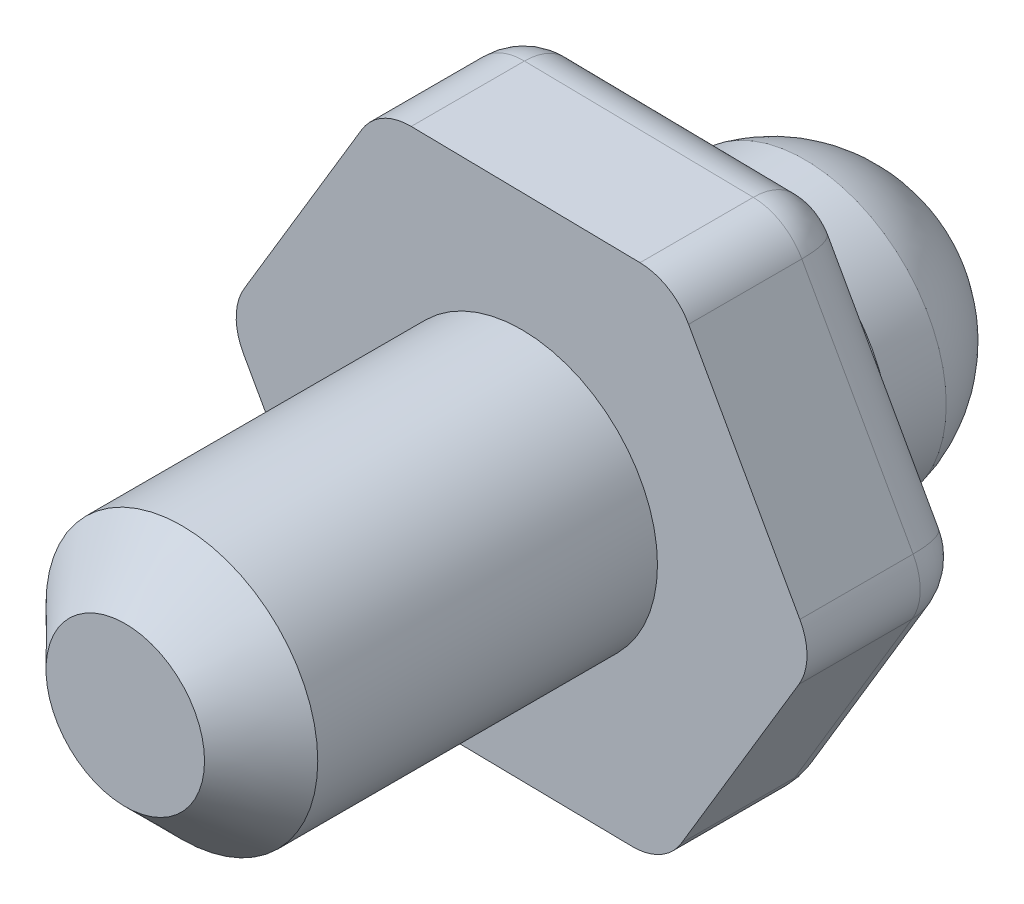
ISO-10303-21;
HEADER;
FILE_DESCRIPTION(('STEP AP214'),'2;1');
FILE_NAME('part.step','',(''),(''),'','','');
FILE_SCHEMA(('AUTOMOTIVE_DESIGN { 1 0 10303 214 1 1 1 1 }'));
ENDSEC;
DATA;
#1=APPLICATION_CONTEXT('core data for automotive mechanical design processes');
#2=APPLICATION_PROTOCOL_DEFINITION('international standard','automotive_design',2000,#1);
#3=PRODUCT_CONTEXT('',#1,'mechanical');
#4=PRODUCT('Part','Part','',(#3));
#5=PRODUCT_RELATED_PRODUCT_CATEGORY('part','',(#4));
#6=PRODUCT_DEFINITION_FORMATION('','',#4);
#7=PRODUCT_DEFINITION_CONTEXT('part definition',#1,'design');
#8=PRODUCT_DEFINITION('design','',#6,#7);
#9=PRODUCT_DEFINITION_SHAPE('','',#8);
#10=(LENGTH_UNIT() NAMED_UNIT(*) SI_UNIT(.MILLI.,.METRE.));
#11=(NAMED_UNIT(*) PLANE_ANGLE_UNIT() SI_UNIT($,.RADIAN.));
#12=(NAMED_UNIT(*) SI_UNIT($,.STERADIAN.) SOLID_ANGLE_UNIT());
#13=UNCERTAINTY_MEASURE_WITH_UNIT(LENGTH_MEASURE(1.E-05),#10,'distance_accuracy_value','');
#14=(GEOMETRIC_REPRESENTATION_CONTEXT(3) GLOBAL_UNCERTAINTY_ASSIGNED_CONTEXT((#13)) GLOBAL_UNIT_ASSIGNED_CONTEXT((#10,
#11,#12)) REPRESENTATION_CONTEXT('',''));
#15=CARTESIAN_POINT('',(0.,0.,0.));
#16=DIRECTION('',(0.,0.,1.));
#17=DIRECTION('',(1.,0.,0.));
#18=AXIS2_PLACEMENT_3D('',#15,#16,#17);
#19=CARTESIAN_POINT('',(-0.180332581401164,-11.4285773462879,-3.81));
#20=DIRECTION('',(0.,0.,1.));
#21=DIRECTION('',(1.,0.,0.));
#22=AXIS2_PLACEMENT_3D('',#19,#20,#21);
#23=PLANE('',#22);
#24=DIRECTION('',(-0.513601160959527,-0.85802904814524,0.));
#25=VECTOR('',#24,1.);
#26=CARTESIAN_POINT('',(-1.27002947254562,-10.7763038718693,-3.81));
#27=LINE('',#26,#25);
#28=CARTESIAN_POINT('',(5.1320050501485,-0.080978383434373,-3.81));
#29=VERTEX_POINT('',#28);
#30=CARTESIAN_POINT('',(2.49587318786269,-4.48493593749582,-3.81));
#31=VERTEX_POINT('',#30);
#32=EDGE_CURVE('E170',#29,#31,#27,.T.);
#33=ORIENTED_EDGE('',*,*,#32,.T.);
#34=DIRECTION('',(-0.999875533358522,0.0157771287315104,0.));
#35=VECTOR('',#34,1.);
#36=CARTESIAN_POINT('',(-0.0701293372115639,-4.44444674577863,-3.81));
#37=LINE('',#36,#35);
#38=CARTESIAN_POINT('',(-2.63613186228581,-4.40395755406144,-3.81));
#39=VERTEX_POINT('',#38);
#40=EDGE_CURVE('E142',#31,#39,#37,.T.);
#41=ORIENTED_EDGE('',*,*,#40,.T.);
#42=DIRECTION('',(-0.486274372398996,0.87380617687675,0.));
#43=VECTOR('',#42,1.);
#44=CARTESIAN_POINT('',(0.92940126323231,-10.8110088933412,-3.81));
#45=LINE('',#44,#43);
#46=CARTESIAN_POINT('',(-5.1320050501485,0.0809783834343736,-3.81));
#47=VERTEX_POINT('',#46);
#48=EDGE_CURVE('E159',#39,#47,#45,.T.);
#49=ORIENTED_EDGE('',*,*,#48,.T.);
#50=DIRECTION('',(0.513601160959527,0.85802904814524,0.));
#51=VECTOR('',#50,1.);
#52=CARTESIAN_POINT('',(-8.8979077105568,-6.21038955093912,-3.81));
#53=LINE('',#52,#51);
#54=CARTESIAN_POINT('',(-2.49587318786268,4.48493593749582,-3.81));
#55=VERTEX_POINT('',#54);
#56=EDGE_CURVE('E165',#47,#55,#53,.T.);
#57=ORIENTED_EDGE('',*,*,#56,.T.);
#58=DIRECTION('',(0.999875533358522,-0.0157771287315104,0.));
#59=VECTOR('',#58,1.);
#60=CARTESIAN_POINT('',(0.0701293372115638,4.44444674577864,-3.81));
#61=LINE('',#60,#59);
#62=CARTESIAN_POINT('',(2.63613186228582,4.40395755406145,-3.81));
#63=VERTEX_POINT('',#62);
#64=EDGE_CURVE('E316',#55,#63,#61,.T.);
#65=ORIENTED_EDGE('',*,*,#64,.T.);
#66=DIRECTION('',(0.486274372398996,-0.873806176876751,0.));
#67=VECTOR('',#66,1.);
#68=CARTESIAN_POINT('',(8.69753817566662,-6.48802972271411,-3.81));
#69=LINE('',#68,#67);
#70=EDGE_CURVE('E175',#63,#29,#69,.T.);
#71=ORIENTED_EDGE('',*,*,#70,.T.);
#72=EDGE_LOOP('',(#33,#41,#49,#57,#65,#71));
#73=FACE_BOUND('',#72,.T.);
#74=CARTESIAN_POINT('',(0.,0.,-3.81));
#75=DIRECTION('',(0.,0.,1.));
#76=DIRECTION('',(1.,0.,0.));
#77=AXIS2_PLACEMENT_3D('',#74,#75,#76);
#78=CIRCLE('',#77,2.02978520685108);
#79=CARTESIAN_POINT('',(2.02978520685108,0.,-3.81));
#80=VERTEX_POINT('',#79);
#81=EDGE_CURVE('E166',#80,#80,#78,.F.);
#82=ORIENTED_EDGE('',*,*,#81,.F.);
#83=EDGE_LOOP('',(#82));
#84=FACE_BOUND('',#83,.T.);
#85=ADVANCED_FACE('F31',(#73,#84),#23,.F.);
#86=CARTESIAN_POINT('',(0.,0.,8.89));
#87=DIRECTION('',(0.,0.,-1.));
#88=DIRECTION('',(-1.,0.,0.));
#89=AXIS2_PLACEMENT_3D('',#86,#87,#88);
#90=CYLINDRICAL_SURFACE('',#89,3.048);
#91=CARTESIAN_POINT('',(0.,0.,7.61999999999999));
#92=DIRECTION('',(0.,0.,1.));
#93=DIRECTION('',(1.,0.,0.));
#94=AXIS2_PLACEMENT_3D('',#91,#92,#93);
#95=CIRCLE('',#94,3.048);
#96=CARTESIAN_POINT('',(3.048,0.,7.61999999999999));
#97=VERTEX_POINT('',#96);
#98=EDGE_CURVE('E308',#97,#97,#95,.F.);
#99=ORIENTED_EDGE('',*,*,#98,.T.);
#100=EDGE_LOOP('',(#99));
#101=FACE_BOUND('',#100,.T.);
#102=CARTESIAN_POINT('',(0.,0.,0.));
#103=DIRECTION('',(0.,0.,1.));
#104=DIRECTION('',(1.,0.,0.));
#105=AXIS2_PLACEMENT_3D('',#102,#103,#104);
#106=CIRCLE('',#105,3.048);
#107=CARTESIAN_POINT('',(3.048,0.,0.));
#108=VERTEX_POINT('',#107);
#109=EDGE_CURVE('E302',#108,#108,#106,.T.);
#110=ORIENTED_EDGE('',*,*,#109,.T.);
#111=EDGE_LOOP('',(#110));
#112=FACE_BOUND('',#111,.T.);
#113=ADVANCED_FACE('F340',(#101,#112),#90,.T.);
#114=CARTESIAN_POINT('',(0.,0.,8.89));
#115=DIRECTION('',(0.,0.,1.));
#116=DIRECTION('',(1.,0.,0.));
#117=AXIS2_PLACEMENT_3D('',#114,#115,#116);
#118=PLANE('',#117);
#119=CARTESIAN_POINT('',(0.,0.,8.89));
#120=DIRECTION('',(0.,0.,1.));
#121=DIRECTION('',(1.,0.,0.));
#122=AXIS2_PLACEMENT_3D('',#119,#120,#121);
#123=CIRCLE('',#122,1.778);
#124=CARTESIAN_POINT('',(1.778,0.,8.89));
#125=VERTEX_POINT('',#124);
#126=EDGE_CURVE('E305',#125,#125,#123,.T.);
#127=ORIENTED_EDGE('',*,*,#126,.T.);
#128=EDGE_LOOP('',(#127));
#129=FACE_BOUND('',#128,.T.);
#130=ADVANCED_FACE('F345',(#129),#118,.T.);
#131=CARTESIAN_POINT('',(0.,0.,8.89));
#132=DIRECTION('',(0.,0.,-1.));
#133=DIRECTION('',(-1.,0.,0.));
#134=AXIS2_PLACEMENT_3D('',#131,#132,#133);
#135=CONICAL_SURFACE('',#134,1.778,0.785398163397447);
#136=ORIENTED_EDGE('',*,*,#98,.F.);
#137=EDGE_LOOP('',(#136));
#138=FACE_BOUND('',#137,.T.);
#139=ORIENTED_EDGE('',*,*,#126,.F.);
#140=EDGE_LOOP('',(#139));
#141=FACE_BOUND('',#140,.T.);
#142=ADVANCED_FACE('F372',(#138,#141),#135,.T.);
#143=CARTESIAN_POINT('',(-0.180332581401164,-11.4285773462879,0.));
#144=DIRECTION('',(0.,0.,1.));
#145=DIRECTION('',(1.,0.,0.));
#146=AXIS2_PLACEMENT_3D('',#143,#144,#145);
#147=PLANE('',#146);
#148=DIRECTION('',(-0.513601160959527,-0.85802904814524,0.));
#149=VECTOR('',#148,1.);
#150=CARTESIAN_POINT('',(6.59829220733379,-0.104115064415622,0.));
#151=LINE('',#150,#149);
#152=CARTESIAN_POINT('',(6.22170194129295,-0.733251857852973,0.));
#153=VERTEX_POINT('',#152);
#154=CARTESIAN_POINT('',(3.58557007900714,-5.13720941191442,0.));
#155=VERTEX_POINT('',#154);
#156=EDGE_CURVE('E224',#153,#155,#151,.T.);
#157=ORIENTED_EDGE('',*,*,#156,.F.);
#158=CARTESIAN_POINT('',(5.1320050501485,-0.0809783834343734,0.));
#159=DIRECTION('',(0.,0.,1.));
#160=DIRECTION('',(1.,0.,0.));
#161=AXIS2_PLACEMENT_3D('',#158,#159,#160);
#162=CIRCLE('',#161,1.27);
#163=CARTESIAN_POINT('',(6.24173889478197,0.536590069512352,0.));
#164=VERTEX_POINT('',#163);
#165=EDGE_CURVE('E11',#153,#164,#162,.T.);
#166=ORIENTED_EDGE('',*,*,#165,.T.);
#167=DIRECTION('',(0.486274372398996,-0.87380617687675,0.));
#168=VECTOR('',#167,1.);
#169=CARTESIAN_POINT('',(3.38931239436748,5.66223114093614,0.));
#170=LINE('',#169,#168);
#171=CARTESIAN_POINT('',(3.74586570691929,5.02152600700817,0.));
#172=VERTEX_POINT('',#171);
#173=EDGE_CURVE('E235',#172,#164,#170,.T.);
#174=ORIENTED_EDGE('',*,*,#173,.F.);
#175=CARTESIAN_POINT('',(2.63613186228581,4.40395755406144,0.));
#176=DIRECTION('',(0.,0.,1.));
#177=DIRECTION('',(1.,0.,0.));
#178=AXIS2_PLACEMENT_3D('',#175,#176,#177);
#179=CIRCLE('',#178,1.27);
#180=CARTESIAN_POINT('',(2.65616881577483,5.67379948142677,0.));
#181=VERTEX_POINT('',#180);
#182=EDGE_CURVE('E214',#172,#181,#179,.T.);
#183=ORIENTED_EDGE('',*,*,#182,.T.);
#184=DIRECTION('',(0.999875533358522,-0.0157771287315104,0.));
#185=VECTOR('',#184,1.);
#186=CARTESIAN_POINT('',(-3.20897981296631,5.76634620535177,0.));
#187=LINE('',#186,#185);
#188=CARTESIAN_POINT('',(-2.47583623437367,5.75477786486114,0.));
#189=VERTEX_POINT('',#188);
#190=EDGE_CURVE('E296',#189,#181,#187,.T.);
#191=ORIENTED_EDGE('',*,*,#190,.F.);
#192=CARTESIAN_POINT('',(-2.49587318786268,4.48493593749582,0.));
#193=DIRECTION('',(0.,0.,1.));
#194=DIRECTION('',(1.,0.,0.));
#195=AXIS2_PLACEMENT_3D('',#192,#193,#194);
#196=CIRCLE('',#195,1.27);
#197=CARTESIAN_POINT('',(-3.58557007900714,5.13720941191442,0.));
#198=VERTEX_POINT('',#197);
#199=EDGE_CURVE('E212',#189,#198,#196,.T.);
#200=ORIENTED_EDGE('',*,*,#199,.T.);
#201=DIRECTION('',(0.513601160959526,0.85802904814524,0.));
#202=VECTOR('',#201,1.);
#203=CARTESIAN_POINT('',(-6.59829220733378,0.104115064415622,0.));
#204=LINE('',#203,#202);
#205=CARTESIAN_POINT('',(-6.22170194129295,0.733251857852972,0.));
#206=VERTEX_POINT('',#205);
#207=EDGE_CURVE('E293',#206,#198,#204,.T.);
#208=ORIENTED_EDGE('',*,*,#207,.F.);
#209=CARTESIAN_POINT('',(-5.1320050501485,0.0809783834343737,0.));
#210=DIRECTION('',(0.,0.,1.));
#211=DIRECTION('',(1.,0.,0.));
#212=AXIS2_PLACEMENT_3D('',#209,#210,#211);
#213=CIRCLE('',#212,1.27);
#214=CARTESIAN_POINT('',(-6.24173889478197,-0.536590069512352,0.));
#215=VERTEX_POINT('',#214);
#216=EDGE_CURVE('E210',#206,#215,#213,.T.);
#217=ORIENTED_EDGE('',*,*,#216,.T.);
#218=DIRECTION('',(-0.486274372398996,0.87380617687675,0.));
#219=VECTOR('',#218,1.);
#220=CARTESIAN_POINT('',(-3.38931239436747,-5.66223114093614,0.));
#221=LINE('',#220,#219);
#222=CARTESIAN_POINT('',(-3.74586570691928,-5.02152600700817,0.));
#223=VERTEX_POINT('',#222);
#224=EDGE_CURVE('E291',#223,#215,#221,.T.);
#225=ORIENTED_EDGE('',*,*,#224,.F.);
#226=CARTESIAN_POINT('',(-2.63613186228581,-4.40395755406144,0.));
#227=DIRECTION('',(0.,0.,1.));
#228=DIRECTION('',(1.,0.,0.));
#229=AXIS2_PLACEMENT_3D('',#226,#227,#228);
#230=CIRCLE('',#229,1.27);
#231=CARTESIAN_POINT('',(-2.65616881577483,-5.67379948142677,0.));
#232=VERTEX_POINT('',#231);
#233=EDGE_CURVE('E216',#223,#232,#230,.T.);
#234=ORIENTED_EDGE('',*,*,#233,.T.);
#235=DIRECTION('',(-0.999875533358522,0.0157771287315104,0.));
#236=VECTOR('',#235,1.);
#237=CARTESIAN_POINT('',(3.20897981296631,-5.76634620535176,0.));
#238=LINE('',#237,#236);
#239=CARTESIAN_POINT('',(2.47583623437367,-5.75477786486114,0.));
#240=VERTEX_POINT('',#239);
#241=EDGE_CURVE('E227',#240,#232,#238,.T.);
#242=ORIENTED_EDGE('',*,*,#241,.F.);
#243=CARTESIAN_POINT('',(2.49587318786269,-4.48493593749582,0.));
#244=DIRECTION('',(0.,0.,1.));
#245=DIRECTION('',(1.,0.,0.));
#246=AXIS2_PLACEMENT_3D('',#243,#244,#245);
#247=CIRCLE('',#246,1.27);
#248=EDGE_CURVE('E39',#240,#155,#247,.T.);
#249=ORIENTED_EDGE('',*,*,#248,.T.);
#250=EDGE_LOOP('',(#157,#166,#174,#183,#191,#200,#208,#217,#225,#234,#242,#249));
#251=FACE_BOUND('',#250,.T.);
#252=ORIENTED_EDGE('',*,*,#109,.F.);
#253=EDGE_LOOP('',(#252));
#254=FACE_BOUND('',#253,.T.);
#255=ADVANCED_FACE('F222',(#251,#254),#147,.T.);
#256=CARTESIAN_POINT('',(-3.38931239436747,-5.66223114093614,-3.81));
#257=DIRECTION('',(0.87380617687675,0.486274372398996,0.));
#258=DIRECTION('',(-0.486274372398996,0.87380617687675,0.));
#259=AXIS2_PLACEMENT_3D('',#256,#257,#258);
#260=PLANE('',#259);
#261=DIRECTION('',(-0.486274372398996,0.87380617687675,0.));
#262=VECTOR('',#261,1.);
#263=CARTESIAN_POINT('',(-3.38931239436747,-5.66223114093614,-2.54));
#264=LINE('',#263,#262);
#265=CARTESIAN_POINT('',(-6.24173889478197,-0.536590069512351,-2.54));
#266=VERTEX_POINT('',#265);
#267=CARTESIAN_POINT('',(-3.74586570691928,-5.02152600700817,-2.54));
#268=VERTEX_POINT('',#267);
#269=EDGE_CURVE('E46',#266,#268,#264,.F.);
#270=ORIENTED_EDGE('',*,*,#269,.T.);
#271=DIRECTION('',(0.,0.,1.));
#272=VECTOR('',#271,1.);
#273=CARTESIAN_POINT('',(-3.74586570691928,-5.02152600700817,-3.81));
#274=LINE('',#273,#272);
#275=EDGE_CURVE('E208',#268,#223,#274,.T.);
#276=ORIENTED_EDGE('',*,*,#275,.T.);
#277=ORIENTED_EDGE('',*,*,#224,.T.);
#278=DIRECTION('',(0.,0.,1.));
#279=VECTOR('',#278,1.);
#280=CARTESIAN_POINT('',(-6.24173889478197,-0.536590069512352,-3.81));
#281=LINE('',#280,#279);
#282=EDGE_CURVE('E51',#215,#266,#281,.F.);
#283=ORIENTED_EDGE('',*,*,#282,.T.);
#284=EDGE_LOOP('',(#270,#276,#277,#283));
#285=FACE_BOUND('',#284,.T.);
#286=ADVANCED_FACE('F368',(#285),#260,.F.);
#287=CARTESIAN_POINT('',(-6.59829220733378,0.104115064415622,-3.81));
#288=DIRECTION('',(0.85802904814524,-0.513601160959526,0.));
#289=DIRECTION('',(0.513601160959527,0.85802904814524,0.));
#290=AXIS2_PLACEMENT_3D('',#287,#288,#289);
#291=PLANE('',#290);
#292=ORIENTED_EDGE('',*,*,#207,.T.);
#293=DIRECTION('',(0.,0.,1.));
#294=VECTOR('',#293,1.);
#295=CARTESIAN_POINT('',(-3.58557007900714,5.13720941191442,-3.81));
#296=LINE('',#295,#294);
#297=CARTESIAN_POINT('',(-3.58557007900714,5.13720941191442,-2.54));
#298=VERTEX_POINT('',#297);
#299=EDGE_CURVE('E204',#198,#298,#296,.F.);
#300=ORIENTED_EDGE('',*,*,#299,.T.);
#301=DIRECTION('',(0.513601160959527,0.85802904814524,0.));
#302=VECTOR('',#301,1.);
#303=CARTESIAN_POINT('',(-6.59829220733378,0.104115064415622,-2.54));
#304=LINE('',#303,#302);
#305=CARTESIAN_POINT('',(-6.22170194129295,0.733251857852972,-2.54));
#306=VERTEX_POINT('',#305);
#307=EDGE_CURVE('E202',#298,#306,#304,.F.);
#308=ORIENTED_EDGE('',*,*,#307,.T.);
#309=DIRECTION('',(0.,0.,1.));
#310=VECTOR('',#309,1.);
#311=CARTESIAN_POINT('',(-6.22170194129295,0.733251857852972,-3.81));
#312=LINE('',#311,#310);
#313=EDGE_CURVE('E200',#306,#206,#312,.T.);
#314=ORIENTED_EDGE('',*,*,#313,.T.);
#315=EDGE_LOOP('',(#292,#300,#308,#314));
#316=FACE_BOUND('',#315,.T.);
#317=ADVANCED_FACE('F364',(#316),#291,.F.);
#318=CARTESIAN_POINT('',(-3.20897981296631,5.76634620535177,-3.81));
#319=DIRECTION('',(-0.0157771287315104,-0.999875533358522,0.));
#320=DIRECTION('',(0.999875533358522,-0.0157771287315104,0.));
#321=AXIS2_PLACEMENT_3D('',#318,#319,#320);
#322=PLANE('',#321);
#323=ORIENTED_EDGE('',*,*,#190,.T.);
#324=DIRECTION('',(0.,0.,1.));
#325=VECTOR('',#324,1.);
#326=CARTESIAN_POINT('',(2.65616881577483,5.67379948142677,-3.81));
#327=LINE('',#326,#325);
#328=CARTESIAN_POINT('',(2.65616881577483,5.67379948142677,-2.54));
#329=VERTEX_POINT('',#328);
#330=EDGE_CURVE('E198',#181,#329,#327,.F.);
#331=ORIENTED_EDGE('',*,*,#330,.T.);
#332=DIRECTION('',(0.999875533358522,-0.0157771287315104,0.));
#333=VECTOR('',#332,1.);
#334=CARTESIAN_POINT('',(-3.20897981296631,5.76634620535177,-2.54));
#335=LINE('',#334,#333);
#336=CARTESIAN_POINT('',(-2.47583623437367,5.75477786486114,-2.54));
#337=VERTEX_POINT('',#336);
#338=EDGE_CURVE('E196',#329,#337,#335,.F.);
#339=ORIENTED_EDGE('',*,*,#338,.T.);
#340=DIRECTION('',(0.,0.,1.));
#341=VECTOR('',#340,1.);
#342=CARTESIAN_POINT('',(-2.47583623437367,5.75477786486114,-3.81));
#343=LINE('',#342,#341);
#344=EDGE_CURVE('E194',#337,#189,#343,.T.);
#345=ORIENTED_EDGE('',*,*,#344,.T.);
#346=EDGE_LOOP('',(#323,#331,#339,#345));
#347=FACE_BOUND('',#346,.T.);
#348=ADVANCED_FACE('F360',(#347),#322,.F.);
#349=CARTESIAN_POINT('',(3.38931239436748,5.66223114093614,-3.81));
#350=DIRECTION('',(-0.873806176876751,-0.486274372398996,0.));
#351=DIRECTION('',(0.486274372398996,-0.873806176876751,0.));
#352=AXIS2_PLACEMENT_3D('',#349,#350,#351);
#353=PLANE('',#352);
#354=ORIENTED_EDGE('',*,*,#173,.T.);
#355=DIRECTION('',(0.,0.,1.));
#356=VECTOR('',#355,1.);
#357=CARTESIAN_POINT('',(6.24173889478197,0.536590069512352,-3.81));
#358=LINE('',#357,#356);
#359=CARTESIAN_POINT('',(6.24173889478197,0.536590069512351,-2.54));
#360=VERTEX_POINT('',#359);
#361=EDGE_CURVE('E192',#164,#360,#358,.F.);
#362=ORIENTED_EDGE('',*,*,#361,.T.);
#363=DIRECTION('',(0.486274372398996,-0.873806176876751,0.));
#364=VECTOR('',#363,1.);
#365=CARTESIAN_POINT('',(3.38931239436748,5.66223114093614,-2.54));
#366=LINE('',#365,#364);
#367=CARTESIAN_POINT('',(3.74586570691929,5.02152600700817,-2.54));
#368=VERTEX_POINT('',#367);
#369=EDGE_CURVE('E190',#360,#368,#366,.F.);
#370=ORIENTED_EDGE('',*,*,#369,.T.);
#371=DIRECTION('',(0.,0.,1.));
#372=VECTOR('',#371,1.);
#373=CARTESIAN_POINT('',(3.74586570691929,5.02152600700817,-3.81));
#374=LINE('',#373,#372);
#375=EDGE_CURVE('E188',#368,#172,#374,.T.);
#376=ORIENTED_EDGE('',*,*,#375,.T.);
#377=EDGE_LOOP('',(#354,#362,#370,#376));
#378=FACE_BOUND('',#377,.T.);
#379=ADVANCED_FACE('F357',(#378),#353,.F.);
#380=CARTESIAN_POINT('',(6.59829220733379,-0.104115064415622,-3.81));
#381=DIRECTION('',(-0.85802904814524,0.513601160959527,0.));
#382=DIRECTION('',(-0.513601160959527,-0.85802904814524,0.));
#383=AXIS2_PLACEMENT_3D('',#380,#381,#382);
#384=PLANE('',#383);
#385=DIRECTION('',(-0.513601160959527,-0.85802904814524,0.));
#386=VECTOR('',#385,1.);
#387=CARTESIAN_POINT('',(6.59829220733379,-0.104115064415622,-2.54));
#388=LINE('',#387,#386);
#389=CARTESIAN_POINT('',(3.58557007900714,-5.13720941191442,-2.54));
#390=VERTEX_POINT('',#389);
#391=CARTESIAN_POINT('',(6.22170194129295,-0.733251857852973,-2.54));
#392=VERTEX_POINT('',#391);
#393=EDGE_CURVE('E184',#390,#392,#388,.F.);
#394=ORIENTED_EDGE('',*,*,#393,.T.);
#395=DIRECTION('',(0.,0.,1.));
#396=VECTOR('',#395,1.);
#397=CARTESIAN_POINT('',(6.22170194129295,-0.733251857852973,-3.81));
#398=LINE('',#397,#396);
#399=EDGE_CURVE('E186',#392,#153,#398,.T.);
#400=ORIENTED_EDGE('',*,*,#399,.T.);
#401=ORIENTED_EDGE('',*,*,#156,.T.);
#402=DIRECTION('',(0.,0.,1.));
#403=VECTOR('',#402,1.);
#404=CARTESIAN_POINT('',(3.58557007900714,-5.13720941191442,-3.81));
#405=LINE('',#404,#403);
#406=EDGE_CURVE('E182',#155,#390,#405,.F.);
#407=ORIENTED_EDGE('',*,*,#406,.T.);
#408=EDGE_LOOP('',(#394,#400,#401,#407));
#409=FACE_BOUND('',#408,.T.);
#410=ADVANCED_FACE('F232',(#409),#384,.F.);
#411=CARTESIAN_POINT('',(3.20897981296631,-5.76634620535176,-3.81));
#412=DIRECTION('',(0.0157771287315104,0.999875533358522,0.));
#413=DIRECTION('',(-0.999875533358522,0.0157771287315104,0.));
#414=AXIS2_PLACEMENT_3D('',#411,#412,#413);
#415=PLANE('',#414);
#416=DIRECTION('',(-0.999875533358522,0.0157771287315104,0.));
#417=VECTOR('',#416,1.);
#418=CARTESIAN_POINT('',(3.20897981296631,-5.76634620535176,-2.54));
#419=LINE('',#418,#417);
#420=CARTESIAN_POINT('',(-2.65616881577483,-5.67379948142677,-2.54));
#421=VERTEX_POINT('',#420);
#422=CARTESIAN_POINT('',(2.47583623437367,-5.75477786486114,-2.54));
#423=VERTEX_POINT('',#422);
#424=EDGE_CURVE('E144',#421,#423,#419,.F.);
#425=ORIENTED_EDGE('',*,*,#424,.T.);
#426=DIRECTION('',(0.,0.,1.));
#427=VECTOR('',#426,1.);
#428=CARTESIAN_POINT('',(2.47583623437367,-5.75477786486114,-3.81));
#429=LINE('',#428,#427);
#430=EDGE_CURVE('E180',#423,#240,#429,.T.);
#431=ORIENTED_EDGE('',*,*,#430,.T.);
#432=ORIENTED_EDGE('',*,*,#241,.T.);
#433=DIRECTION('',(0.,0.,1.));
#434=VECTOR('',#433,1.);
#435=CARTESIAN_POINT('',(-2.65616881577483,-5.67379948142677,-3.81));
#436=LINE('',#435,#434);
#437=EDGE_CURVE('E172',#232,#421,#436,.F.);
#438=ORIENTED_EDGE('',*,*,#437,.T.);
#439=EDGE_LOOP('',(#425,#431,#432,#438));
#440=FACE_BOUND('',#439,.T.);
#441=ADVANCED_FACE('F350',(#440),#415,.F.);
#442=CARTESIAN_POINT('',(0.,0.,-5.08));
#443=DIRECTION('',(0.,0.,1.));
#444=DIRECTION('',(1.,0.,0.));
#445=AXIS2_PLACEMENT_3D('',#442,#443,#444);
#446=CYLINDRICAL_SURFACE('',#445,2.02978520685108);
#447=CARTESIAN_POINT('',(0.,0.,-5.08));
#448=DIRECTION('',(0.,0.,-1.));
#449=DIRECTION('',(-1.,0.,0.));
#450=AXIS2_PLACEMENT_3D('',#447,#448,#449);
#451=CIRCLE('',#450,2.02978520685108);
#452=CARTESIAN_POINT('',(-2.02978520685108,0.,-5.08));
#453=VERTEX_POINT('',#452);
#454=EDGE_CURVE('E288',#453,#453,#451,.T.);
#455=ORIENTED_EDGE('',*,*,#454,.F.);
#456=EDGE_LOOP('',(#455));
#457=FACE_BOUND('',#456,.T.);
#458=ORIENTED_EDGE('',*,*,#81,.T.);
#459=EDGE_LOOP('',(#458));
#460=FACE_BOUND('',#459,.T.);
#461=ADVANCED_FACE('F353',(#457,#460),#446,.T.);
#462=CARTESIAN_POINT('',(0.,0.,-5.08));
#463=DIRECTION('',(0.,0.,-1.));
#464=DIRECTION('',(-1.,0.,0.));
#465=AXIS2_PLACEMENT_3D('',#462,#463,#464);
#466=PLANE('',#465);
#467=CARTESIAN_POINT('',(0.,0.,-5.08));
#468=DIRECTION('',(0.,0.,-1.));
#469=DIRECTION('',(-1.,0.,0.));
#470=AXIS2_PLACEMENT_3D('',#467,#468,#469);
#471=CIRCLE('',#470,3.175);
#472=CARTESIAN_POINT('',(-3.175,0.,-5.08));
#473=VERTEX_POINT('',#472);
#474=EDGE_CURVE('E284',#473,#473,#471,.T.);
#475=ORIENTED_EDGE('',*,*,#474,.F.);
#476=EDGE_LOOP('',(#475));
#477=FACE_BOUND('',#476,.T.);
#478=ORIENTED_EDGE('',*,*,#454,.T.);
#479=EDGE_LOOP('',(#478));
#480=FACE_BOUND('',#479,.T.);
#481=ADVANCED_FACE('F424',(#477,#480),#466,.F.);
#482=CARTESIAN_POINT('',(0.,0.,-6.35));
#483=DIRECTION('',(0.,0.,1.));
#484=DIRECTION('',(1.,0.,0.));
#485=AXIS2_PLACEMENT_3D('',#482,#483,#484);
#486=CYLINDRICAL_SURFACE('',#485,3.175);
#487=CARTESIAN_POINT('',(0.,0.,-6.35));
#488=DIRECTION('',(0.,0.,-1.));
#489=DIRECTION('',(-1.,0.,0.));
#490=AXIS2_PLACEMENT_3D('',#487,#488,#489);
#491=CIRCLE('',#490,3.175);
#492=CARTESIAN_POINT('',(-3.175,0.,-6.35));
#493=VERTEX_POINT('',#492);
#494=EDGE_CURVE('E287',#493,#493,#491,.T.);
#495=ORIENTED_EDGE('',*,*,#494,.F.);
#496=EDGE_LOOP('',(#495));
#497=FACE_BOUND('',#496,.T.);
#498=ORIENTED_EDGE('',*,*,#474,.T.);
#499=EDGE_LOOP('',(#498));
#500=FACE_BOUND('',#499,.T.);
#501=ADVANCED_FACE('F431',(#497,#500),#486,.T.);
#502=CARTESIAN_POINT('',(0.,0.,-5.635625));
#503=DIRECTION('',(0.,0.,1.));
#504=DIRECTION('',(1.,0.,0.));
#505=AXIS2_PLACEMENT_3D('',#502,#503,#504);
#506=SPHERICAL_SURFACE('',#505,3.254375);
#507=ORIENTED_EDGE('',*,*,#494,.T.);
#508=EDGE_LOOP('',(#507));
#509=FACE_BOUND('',#508,.T.);
#510=ADVANCED_FACE('F33',(#509),#506,.T.);
#511=CARTESIAN_POINT('',(2.63613186228581,4.40395755406144,-3.81));
#512=DIRECTION('',(0.,0.,1.));
#513=DIRECTION('',(1.,0.,0.));
#514=AXIS2_PLACEMENT_3D('',#511,#512,#513);
#515=CYLINDRICAL_SURFACE('',#514,1.27);
#516=ORIENTED_EDGE('',*,*,#182,.F.);
#517=ORIENTED_EDGE('',*,*,#375,.F.);
#518=CARTESIAN_POINT('',(2.63613186228581,4.40395755406144,-2.54));
#519=DIRECTION('',(0.,0.,-1.));
#520=DIRECTION('',(-1.,0.,0.));
#521=AXIS2_PLACEMENT_3D('',#518,#519,#520);
#522=CIRCLE('',#521,1.27);
#523=EDGE_CURVE('E281',#329,#368,#522,.T.);
#524=ORIENTED_EDGE('',*,*,#523,.F.);
#525=ORIENTED_EDGE('',*,*,#330,.F.);
#526=EDGE_LOOP('',(#516,#517,#524,#525));
#527=FACE_BOUND('',#526,.T.);
#528=ADVANCED_FACE('F446',(#527),#515,.T.);
#529=CARTESIAN_POINT('',(0.0701293372115638,4.44444674577863,-2.54));
#530=DIRECTION('',(0.999875533358522,-0.0157771287315104,0.));
#531=DIRECTION('',(0.0157771287315104,0.999875533358522,0.));
#532=AXIS2_PLACEMENT_3D('',#529,#530,#531);
#533=CYLINDRICAL_SURFACE('',#532,1.27);
#534=CARTESIAN_POINT('',(-2.49587318786268,4.48493593749582,-2.54));
#535=DIRECTION('',(-0.999875533358522,0.0157771287315105,0.));
#536=DIRECTION('',(-0.0157771287315105,-0.999875533358522,0.));
#537=AXIS2_PLACEMENT_3D('',#534,#535,#536);
#538=CIRCLE('',#537,1.27);
#539=EDGE_CURVE('E275',#337,#55,#538,.T.);
#540=ORIENTED_EDGE('',*,*,#539,.F.);
#541=ORIENTED_EDGE('',*,*,#338,.F.);
#542=CARTESIAN_POINT('',(2.63613186228582,4.40395755406145,-2.54));
#543=DIRECTION('',(0.999875533358522,-0.0157771287315099,0.));
#544=DIRECTION('',(0.0157771287315099,0.999875533358522,0.));
#545=AXIS2_PLACEMENT_3D('',#542,#543,#544);
#546=CIRCLE('',#545,1.27);
#547=EDGE_CURVE('E278',#63,#329,#546,.T.);
#548=ORIENTED_EDGE('',*,*,#547,.F.);
#549=ORIENTED_EDGE('',*,*,#64,.F.);
#550=EDGE_LOOP('',(#540,#541,#548,#549));
#551=FACE_BOUND('',#550,.T.);
#552=ADVANCED_FACE('F452',(#551),#533,.T.);
#553=CARTESIAN_POINT('',(-2.49587318786268,4.48493593749582,-3.81));
#554=DIRECTION('',(0.,0.,1.));
#555=DIRECTION('',(1.,0.,0.));
#556=AXIS2_PLACEMENT_3D('',#553,#554,#555);
#557=CYLINDRICAL_SURFACE('',#556,1.27);
#558=ORIENTED_EDGE('',*,*,#199,.F.);
#559=ORIENTED_EDGE('',*,*,#344,.F.);
#560=CARTESIAN_POINT('',(-2.49587318786268,4.48493593749582,-2.54));
#561=DIRECTION('',(0.,0.,-1.));
#562=DIRECTION('',(-1.,0.,0.));
#563=AXIS2_PLACEMENT_3D('',#560,#561,#562);
#564=CIRCLE('',#563,1.27);
#565=EDGE_CURVE('E272',#298,#337,#564,.T.);
#566=ORIENTED_EDGE('',*,*,#565,.F.);
#567=ORIENTED_EDGE('',*,*,#299,.F.);
#568=EDGE_LOOP('',(#558,#559,#566,#567));
#569=FACE_BOUND('',#568,.T.);
#570=ADVANCED_FACE('F460',(#569),#557,.T.);
#571=CARTESIAN_POINT('',(2.63613186228581,4.40395755406144,-2.54));
#572=DIRECTION('',(0.,0.,1.));
#573=DIRECTION('',(1.,0.,0.));
#574=AXIS2_PLACEMENT_3D('',#571,#572,#573);
#575=SPHERICAL_SURFACE('',#574,1.27);
#576=ORIENTED_EDGE('',*,*,#547,.T.);
#577=ORIENTED_EDGE('',*,*,#523,.T.);
#578=CARTESIAN_POINT('',(2.63613186228581,4.40395755406144,-2.54));
#579=DIRECTION('',(-0.486274372398996,0.87380617687675,0.));
#580=DIRECTION('',(-0.87380617687675,-0.486274372398996,0.));
#581=AXIS2_PLACEMENT_3D('',#578,#579,#580);
#582=CIRCLE('',#581,1.27);
#583=EDGE_CURVE('E269',#63,#368,#582,.F.);
#584=ORIENTED_EDGE('',*,*,#583,.F.);
#585=EDGE_LOOP('',(#576,#577,#584));
#586=FACE_BOUND('',#585,.T.);
#587=ADVANCED_FACE('F468',(#586),#575,.T.);
#588=CARTESIAN_POINT('',(-2.49587318786268,4.48493593749582,-2.54));
#589=DIRECTION('',(0.,0.,1.));
#590=DIRECTION('',(1.,0.,0.));
#591=AXIS2_PLACEMENT_3D('',#588,#589,#590);
#592=SPHERICAL_SURFACE('',#591,1.27);
#593=ORIENTED_EDGE('',*,*,#565,.T.);
#594=ORIENTED_EDGE('',*,*,#539,.T.);
#595=CARTESIAN_POINT('',(-2.49587318786268,4.48493593749582,-2.54));
#596=DIRECTION('',(0.513601160959525,0.858029048145241,0.));
#597=DIRECTION('',(-0.858029048145241,0.513601160959525,0.));
#598=AXIS2_PLACEMENT_3D('',#595,#596,#597);
#599=CIRCLE('',#598,1.27);
#600=EDGE_CURVE('E266',#298,#55,#599,.F.);
#601=ORIENTED_EDGE('',*,*,#600,.F.);
#602=EDGE_LOOP('',(#593,#594,#601));
#603=FACE_BOUND('',#602,.T.);
#604=ADVANCED_FACE('F476',(#603),#592,.T.);
#605=CARTESIAN_POINT('',(5.1320050501485,-0.0809783834343734,-3.81));
#606=DIRECTION('',(0.,0.,1.));
#607=DIRECTION('',(1.,0.,0.));
#608=AXIS2_PLACEMENT_3D('',#605,#606,#607);
#609=CYLINDRICAL_SURFACE('',#608,1.27);
#610=ORIENTED_EDGE('',*,*,#165,.F.);
#611=ORIENTED_EDGE('',*,*,#399,.F.);
#612=CARTESIAN_POINT('',(5.1320050501485,-0.0809783834343734,-2.54));
#613=DIRECTION('',(0.,0.,-1.));
#614=DIRECTION('',(-1.,0.,0.));
#615=AXIS2_PLACEMENT_3D('',#612,#613,#614);
#616=CIRCLE('',#615,1.27);
#617=EDGE_CURVE('E263',#360,#392,#616,.T.);
#618=ORIENTED_EDGE('',*,*,#617,.F.);
#619=ORIENTED_EDGE('',*,*,#361,.F.);
#620=EDGE_LOOP('',(#610,#611,#618,#619));
#621=FACE_BOUND('',#620,.T.);
#622=ADVANCED_FACE('F484',(#621),#609,.T.);
#623=CARTESIAN_POINT('',(8.69753817566662,-6.48802972271411,-2.54));
#624=DIRECTION('',(0.486274372398996,-0.873806176876751,0.));
#625=DIRECTION('',(0.873806176876751,0.486274372398996,0.));
#626=AXIS2_PLACEMENT_3D('',#623,#624,#625);
#627=CYLINDRICAL_SURFACE('',#626,1.27);
#628=ORIENTED_EDGE('',*,*,#583,.T.);
#629=ORIENTED_EDGE('',*,*,#369,.F.);
#630=CARTESIAN_POINT('',(5.1320050501485,-0.080978383434373,-2.54));
#631=DIRECTION('',(0.486274372398996,-0.87380617687675,0.));
#632=DIRECTION('',(0.87380617687675,0.486274372398996,0.));
#633=AXIS2_PLACEMENT_3D('',#630,#631,#632);
#634=CIRCLE('',#633,1.27);
#635=EDGE_CURVE('E260',#29,#360,#634,.T.);
#636=ORIENTED_EDGE('',*,*,#635,.F.);
#637=ORIENTED_EDGE('',*,*,#70,.F.);
#638=EDGE_LOOP('',(#628,#629,#636,#637));
#639=FACE_BOUND('',#638,.T.);
#640=ADVANCED_FACE('F324',(#639),#627,.T.);
#641=CARTESIAN_POINT('',(-8.8979077105568,-6.21038955093912,-2.54));
#642=DIRECTION('',(0.513601160959527,0.85802904814524,0.));
#643=DIRECTION('',(-0.85802904814524,0.513601160959526,0.));
#644=AXIS2_PLACEMENT_3D('',#641,#642,#643);
#645=CYLINDRICAL_SURFACE('',#644,1.27);
#646=ORIENTED_EDGE('',*,*,#600,.T.);
#647=ORIENTED_EDGE('',*,*,#56,.F.);
#648=CARTESIAN_POINT('',(-5.1320050501485,0.0809783834343738,-2.54));
#649=DIRECTION('',(-0.513601160959526,-0.85802904814524,0.));
#650=DIRECTION('',(0.85802904814524,-0.513601160959526,0.));
#651=AXIS2_PLACEMENT_3D('',#648,#649,#650);
#652=CIRCLE('',#651,1.27);
#653=EDGE_CURVE('E257',#306,#47,#652,.T.);
#654=ORIENTED_EDGE('',*,*,#653,.F.);
#655=ORIENTED_EDGE('',*,*,#307,.F.);
#656=EDGE_LOOP('',(#646,#647,#654,#655));
#657=FACE_BOUND('',#656,.T.);
#658=ADVANCED_FACE('F499',(#657),#645,.T.);
#659=CARTESIAN_POINT('',(-5.1320050501485,0.0809783834343737,-3.81));
#660=DIRECTION('',(0.,0.,1.));
#661=DIRECTION('',(1.,0.,0.));
#662=AXIS2_PLACEMENT_3D('',#659,#660,#661);
#663=CYLINDRICAL_SURFACE('',#662,1.27);
#664=ORIENTED_EDGE('',*,*,#216,.F.);
#665=ORIENTED_EDGE('',*,*,#313,.F.);
#666=CARTESIAN_POINT('',(-5.1320050501485,0.0809783834343736,-2.54));
#667=DIRECTION('',(0.,0.,-1.));
#668=DIRECTION('',(-1.,0.,0.));
#669=AXIS2_PLACEMENT_3D('',#666,#667,#668);
#670=CIRCLE('',#669,1.27);
#671=EDGE_CURVE('E254',#266,#306,#670,.T.);
#672=ORIENTED_EDGE('',*,*,#671,.F.);
#673=ORIENTED_EDGE('',*,*,#282,.F.);
#674=EDGE_LOOP('',(#664,#665,#672,#673));
#675=FACE_BOUND('',#674,.T.);
#676=ADVANCED_FACE('F506',(#675),#663,.T.);
#677=CARTESIAN_POINT('',(5.1320050501485,-0.0809783834343736,-2.54));
#678=DIRECTION('',(0.,0.,1.));
#679=DIRECTION('',(1.,0.,0.));
#680=AXIS2_PLACEMENT_3D('',#677,#678,#679);
#681=SPHERICAL_SURFACE('',#680,1.27);
#682=ORIENTED_EDGE('',*,*,#635,.T.);
#683=ORIENTED_EDGE('',*,*,#617,.T.);
#684=CARTESIAN_POINT('',(5.1320050501485,-0.0809783834343737,-2.54));
#685=DIRECTION('',(0.513601160959527,0.85802904814524,0.));
#686=DIRECTION('',(-0.85802904814524,0.513601160959527,0.));
#687=AXIS2_PLACEMENT_3D('',#684,#685,#686);
#688=CIRCLE('',#687,1.27);
#689=EDGE_CURVE('E251',#29,#392,#688,.F.);
#690=ORIENTED_EDGE('',*,*,#689,.F.);
#691=EDGE_LOOP('',(#682,#683,#690));
#692=FACE_BOUND('',#691,.T.);
#693=ADVANCED_FACE('F327',(#692),#681,.T.);
#694=CARTESIAN_POINT('',(-5.1320050501485,0.0809783834343736,-2.54));
#695=DIRECTION('',(0.,0.,1.));
#696=DIRECTION('',(1.,0.,0.));
#697=AXIS2_PLACEMENT_3D('',#694,#695,#696);
#698=SPHERICAL_SURFACE('',#697,1.27);
#699=ORIENTED_EDGE('',*,*,#671,.T.);
#700=ORIENTED_EDGE('',*,*,#653,.T.);
#701=CARTESIAN_POINT('',(-5.1320050501485,0.0809783834343736,-2.54));
#702=DIRECTION('',(-0.486274372398996,0.87380617687675,0.));
#703=DIRECTION('',(-0.87380617687675,-0.486274372398996,0.));
#704=AXIS2_PLACEMENT_3D('',#701,#702,#703);
#705=CIRCLE('',#704,1.27);
#706=EDGE_CURVE('E162',#266,#47,#705,.F.);
#707=ORIENTED_EDGE('',*,*,#706,.F.);
#708=EDGE_LOOP('',(#699,#700,#707));
#709=FACE_BOUND('',#708,.T.);
#710=ADVANCED_FACE('F337',(#709),#698,.T.);
#711=CARTESIAN_POINT('',(2.49587318786269,-4.48493593749582,-3.81));
#712=DIRECTION('',(0.,0.,1.));
#713=DIRECTION('',(1.,0.,0.));
#714=AXIS2_PLACEMENT_3D('',#711,#712,#713);
#715=CYLINDRICAL_SURFACE('',#714,1.27);
#716=ORIENTED_EDGE('',*,*,#248,.F.);
#717=ORIENTED_EDGE('',*,*,#430,.F.);
#718=CARTESIAN_POINT('',(2.49587318786269,-4.48493593749582,-2.54));
#719=DIRECTION('',(0.,0.,-1.));
#720=DIRECTION('',(-1.,0.,0.));
#721=AXIS2_PLACEMENT_3D('',#718,#719,#720);
#722=CIRCLE('',#721,1.27);
#723=EDGE_CURVE('E240',#390,#423,#722,.T.);
#724=ORIENTED_EDGE('',*,*,#723,.F.);
#725=ORIENTED_EDGE('',*,*,#406,.F.);
#726=EDGE_LOOP('',(#716,#717,#724,#725));
#727=FACE_BOUND('',#726,.T.);
#728=ADVANCED_FACE('F238',(#727),#715,.T.);
#729=CARTESIAN_POINT('',(-1.27002947254562,-10.7763038718693,-2.54));
#730=DIRECTION('',(-0.513601160959527,-0.85802904814524,0.));
#731=DIRECTION('',(0.85802904814524,-0.513601160959527,0.));
#732=AXIS2_PLACEMENT_3D('',#729,#730,#731);
#733=CYLINDRICAL_SURFACE('',#732,1.27);
#734=ORIENTED_EDGE('',*,*,#689,.T.);
#735=ORIENTED_EDGE('',*,*,#393,.F.);
#736=CARTESIAN_POINT('',(2.49587318786269,-4.48493593749582,-2.54));
#737=DIRECTION('',(-0.513601160959528,-0.858029048145239,0.));
#738=DIRECTION('',(0.858029048145239,-0.513601160959528,0.));
#739=AXIS2_PLACEMENT_3D('',#736,#737,#738);
#740=CIRCLE('',#739,1.27);
#741=EDGE_CURVE('E156',#31,#390,#740,.T.);
#742=ORIENTED_EDGE('',*,*,#741,.F.);
#743=ORIENTED_EDGE('',*,*,#32,.F.);
#744=EDGE_LOOP('',(#734,#735,#742,#743));
#745=FACE_BOUND('',#744,.T.);
#746=ADVANCED_FACE('F328',(#745),#733,.T.);
#747=CARTESIAN_POINT('',(0.92940126323231,-10.8110088933412,-2.54));
#748=DIRECTION('',(-0.486274372398996,0.87380617687675,0.));
#749=DIRECTION('',(-0.87380617687675,-0.486274372398996,0.));
#750=AXIS2_PLACEMENT_3D('',#747,#748,#749);
#751=CYLINDRICAL_SURFACE('',#750,1.27);
#752=ORIENTED_EDGE('',*,*,#706,.T.);
#753=ORIENTED_EDGE('',*,*,#48,.F.);
#754=CARTESIAN_POINT('',(-2.63613186228581,-4.40395755406144,-2.54));
#755=DIRECTION('',(0.486274372398996,-0.87380617687675,0.));
#756=DIRECTION('',(0.87380617687675,0.486274372398996,0.));
#757=AXIS2_PLACEMENT_3D('',#754,#755,#756);
#758=CIRCLE('',#757,1.27);
#759=EDGE_CURVE('E150',#268,#39,#758,.T.);
#760=ORIENTED_EDGE('',*,*,#759,.F.);
#761=ORIENTED_EDGE('',*,*,#269,.F.);
#762=EDGE_LOOP('',(#752,#753,#760,#761));
#763=FACE_BOUND('',#762,.T.);
#764=ADVANCED_FACE('F160',(#763),#751,.T.);
#765=CARTESIAN_POINT('',(-2.63613186228581,-4.40395755406144,-3.81));
#766=DIRECTION('',(0.,0.,1.));
#767=DIRECTION('',(1.,0.,0.));
#768=AXIS2_PLACEMENT_3D('',#765,#766,#767);
#769=CYLINDRICAL_SURFACE('',#768,1.27);
#770=ORIENTED_EDGE('',*,*,#233,.F.);
#771=ORIENTED_EDGE('',*,*,#275,.F.);
#772=CARTESIAN_POINT('',(-2.63613186228581,-4.40395755406144,-2.54));
#773=DIRECTION('',(0.,0.,-1.));
#774=DIRECTION('',(-1.,0.,0.));
#775=AXIS2_PLACEMENT_3D('',#772,#773,#774);
#776=CIRCLE('',#775,1.27);
#777=EDGE_CURVE('E154',#421,#268,#776,.T.);
#778=ORIENTED_EDGE('',*,*,#777,.F.);
#779=ORIENTED_EDGE('',*,*,#437,.F.);
#780=EDGE_LOOP('',(#770,#771,#778,#779));
#781=FACE_BOUND('',#780,.T.);
#782=ADVANCED_FACE('F335',(#781),#769,.T.);
#783=CARTESIAN_POINT('',(2.49587318786269,-4.48493593749582,-2.54));
#784=DIRECTION('',(0.,0.,1.));
#785=DIRECTION('',(1.,0.,0.));
#786=AXIS2_PLACEMENT_3D('',#783,#784,#785);
#787=SPHERICAL_SURFACE('',#786,1.27);
#788=ORIENTED_EDGE('',*,*,#741,.T.);
#789=ORIENTED_EDGE('',*,*,#723,.T.);
#790=CARTESIAN_POINT('',(2.49587318786269,-4.48493593749582,-2.54));
#791=DIRECTION('',(0.999875533358522,-0.0157771287315105,0.));
#792=DIRECTION('',(0.0157771287315105,0.999875533358522,0.));
#793=AXIS2_PLACEMENT_3D('',#790,#791,#792);
#794=CIRCLE('',#793,1.27);
#795=EDGE_CURVE('E147',#31,#423,#794,.F.);
#796=ORIENTED_EDGE('',*,*,#795,.F.);
#797=EDGE_LOOP('',(#788,#789,#796));
#798=FACE_BOUND('',#797,.T.);
#799=ADVANCED_FACE('F245',(#798),#787,.T.);
#800=CARTESIAN_POINT('',(-2.63613186228581,-4.40395755406144,-2.54));
#801=DIRECTION('',(0.,0.,1.));
#802=DIRECTION('',(1.,0.,0.));
#803=AXIS2_PLACEMENT_3D('',#800,#801,#802);
#804=SPHERICAL_SURFACE('',#803,1.27);
#805=ORIENTED_EDGE('',*,*,#777,.T.);
#806=ORIENTED_EDGE('',*,*,#759,.T.);
#807=CARTESIAN_POINT('',(-2.63613186228581,-4.40395755406144,-2.54));
#808=DIRECTION('',(-0.999875533358522,0.0157771287315099,0.));
#809=DIRECTION('',(-0.0157771287315099,-0.999875533358522,0.));
#810=AXIS2_PLACEMENT_3D('',#807,#808,#809);
#811=CIRCLE('',#810,1.27);
#812=EDGE_CURVE('E138',#421,#39,#811,.F.);
#813=ORIENTED_EDGE('',*,*,#812,.F.);
#814=EDGE_LOOP('',(#805,#806,#813));
#815=FACE_BOUND('',#814,.T.);
#816=ADVANCED_FACE('F152',(#815),#804,.T.);
#817=CARTESIAN_POINT('',(-0.0701293372115639,-4.44444674577863,-2.54));
#818=DIRECTION('',(-0.999875533358522,0.0157771287315104,0.));
#819=DIRECTION('',(-0.0157771287315104,-0.999875533358522,0.));
#820=AXIS2_PLACEMENT_3D('',#817,#818,#819);
#821=CYLINDRICAL_SURFACE('',#820,1.27);
#822=ORIENTED_EDGE('',*,*,#795,.T.);
#823=ORIENTED_EDGE('',*,*,#424,.F.);
#824=ORIENTED_EDGE('',*,*,#812,.T.);
#825=ORIENTED_EDGE('',*,*,#40,.F.);
#826=EDGE_LOOP('',(#822,#823,#824,#825));
#827=FACE_BOUND('',#826,.T.);
#828=ADVANCED_FACE('F140',(#827),#821,.T.);
#829=CLOSED_SHELL('',(#85,#113,#130,#142,#255,#286,#317,#348,#379,#410,#441,#461,#481,#501,#510,
#528,#552,#570,#587,#604,#622,#640,#658,#676,#693,#710,#728,#746,#764,#782,#799,#816,#828));
#830=MANIFOLD_SOLID_BREP('B2',#829);
#831=ADVANCED_BREP_SHAPE_REPRESENTATION('',(#18,#830),#14);
#832=SHAPE_DEFINITION_REPRESENTATION(#9,#831);
ENDSEC;
END-ISO-10303-21;
